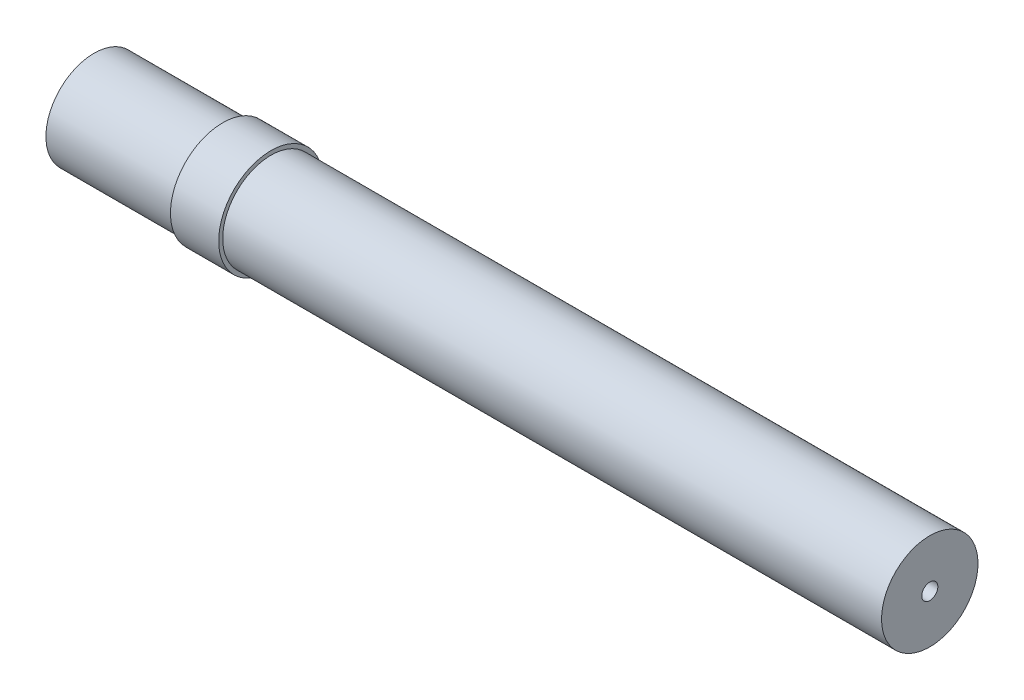
ISO-10303-21;
HEADER;
FILE_DESCRIPTION(('STEP AP214'),'2;1');
FILE_NAME('part.step','',(''),(''),'','','');
FILE_SCHEMA(('AUTOMOTIVE_DESIGN { 1 0 10303 214 1 1 1 1 }'));
ENDSEC;
DATA;
#1=APPLICATION_CONTEXT('core data for automotive mechanical design processes');
#2=APPLICATION_PROTOCOL_DEFINITION('international standard','automotive_design',2000,#1);
#3=PRODUCT_CONTEXT('',#1,'mechanical');
#4=PRODUCT('Part','Part','',(#3));
#5=PRODUCT_RELATED_PRODUCT_CATEGORY('part','',(#4));
#6=PRODUCT_DEFINITION_FORMATION('','',#4);
#7=PRODUCT_DEFINITION_CONTEXT('part definition',#1,'design');
#8=PRODUCT_DEFINITION('design','',#6,#7);
#9=PRODUCT_DEFINITION_SHAPE('','',#8);
#10=(LENGTH_UNIT() NAMED_UNIT(*) SI_UNIT(.MILLI.,.METRE.));
#11=(NAMED_UNIT(*) PLANE_ANGLE_UNIT() SI_UNIT($,.RADIAN.));
#12=(NAMED_UNIT(*) SI_UNIT($,.STERADIAN.) SOLID_ANGLE_UNIT());
#13=UNCERTAINTY_MEASURE_WITH_UNIT(LENGTH_MEASURE(1.E-05),#10,'distance_accuracy_value','');
#14=(GEOMETRIC_REPRESENTATION_CONTEXT(3) GLOBAL_UNCERTAINTY_ASSIGNED_CONTEXT((#13)) GLOBAL_UNIT_ASSIGNED_CONTEXT((#10,
#11,#12)) REPRESENTATION_CONTEXT('',''));
#15=CARTESIAN_POINT('',(0.,0.,0.));
#16=DIRECTION('',(0.,0.,1.));
#17=DIRECTION('',(1.,0.,0.));
#18=AXIS2_PLACEMENT_3D('',#15,#16,#17);
#19=CARTESIAN_POINT('',(13.5,0.,0.));
#20=DIRECTION('',(1.,0.,0.));
#21=DIRECTION('',(0.,0.,-1.));
#22=AXIS2_PLACEMENT_3D('',#19,#20,#21);
#23=CYLINDRICAL_SURFACE('',#22,3.25);
#24=CARTESIAN_POINT('',(-33.,0.,0.));
#25=DIRECTION('',(1.,0.,0.));
#26=DIRECTION('',(0.,0.,-1.));
#27=AXIS2_PLACEMENT_3D('',#24,#25,#26);
#28=CIRCLE('',#27,3.24999999999999);
#29=CARTESIAN_POINT('',(-33.,0.,-3.24999999999999));
#30=VERTEX_POINT('',#29);
#31=EDGE_CURVE('E10',#30,#30,#28,.T.);
#32=ORIENTED_EDGE('',*,*,#31,.T.);
#33=EDGE_LOOP('',(#32));
#34=FACE_BOUND('',#33,.T.);
#35=CARTESIAN_POINT('',(-30.,0.,0.));
#36=DIRECTION('',(1.,0.,0.));
#37=DIRECTION('',(0.,0.,-1.));
#38=AXIS2_PLACEMENT_3D('',#35,#36,#37);
#39=CIRCLE('',#38,3.25);
#40=CARTESIAN_POINT('',(-30.,0.,-3.25));
#41=VERTEX_POINT('',#40);
#42=EDGE_CURVE('E86',#41,#41,#39,.T.);
#43=ORIENTED_EDGE('',*,*,#42,.F.);
#44=EDGE_LOOP('',(#43));
#45=FACE_BOUND('',#44,.T.);
#46=ADVANCED_FACE('F43',(#34,#45),#23,.T.);
#47=CARTESIAN_POINT('',(-33.,3.24999999999999,0.));
#48=DIRECTION('',(-1.,0.,0.));
#49=DIRECTION('',(0.,0.,1.));
#50=AXIS2_PLACEMENT_3D('',#47,#48,#49);
#51=PLANE('',#50);
#52=CARTESIAN_POINT('',(-33.,0.,0.));
#53=DIRECTION('',(1.,0.,0.));
#54=DIRECTION('',(0.,0.,-1.));
#55=AXIS2_PLACEMENT_3D('',#52,#53,#54);
#56=CIRCLE('',#55,2.99999999999999);
#57=CARTESIAN_POINT('',(-33.,0.,-2.99999999999999));
#58=VERTEX_POINT('',#57);
#59=EDGE_CURVE('E50',#58,#58,#56,.T.);
#60=ORIENTED_EDGE('',*,*,#59,.T.);
#61=EDGE_LOOP('',(#60));
#62=FACE_BOUND('',#61,.T.);
#63=ORIENTED_EDGE('',*,*,#31,.F.);
#64=EDGE_LOOP('',(#63));
#65=FACE_BOUND('',#64,.T.);
#66=ADVANCED_FACE('F95',(#62,#65),#51,.T.);
#67=CARTESIAN_POINT('',(13.5,0.,0.));
#68=DIRECTION('',(1.,0.,0.));
#69=DIRECTION('',(0.,0.,-1.));
#70=AXIS2_PLACEMENT_3D('',#67,#68,#69);
#71=CYLINDRICAL_SURFACE('',#70,2.99999999999999);
#72=CARTESIAN_POINT('',(-41.,0.,0.));
#73=DIRECTION('',(1.,0.,0.));
#74=DIRECTION('',(0.,0.,-1.));
#75=AXIS2_PLACEMENT_3D('',#72,#73,#74);
#76=CIRCLE('',#75,2.99999999999999);
#77=CARTESIAN_POINT('',(-41.,0.,-2.99999999999999));
#78=VERTEX_POINT('',#77);
#79=EDGE_CURVE('E55',#78,#78,#76,.T.);
#80=ORIENTED_EDGE('',*,*,#79,.T.);
#81=EDGE_LOOP('',(#80));
#82=FACE_BOUND('',#81,.T.);
#83=ORIENTED_EDGE('',*,*,#59,.F.);
#84=EDGE_LOOP('',(#83));
#85=FACE_BOUND('',#84,.T.);
#86=ADVANCED_FACE('F99',(#82,#85),#71,.T.);
#87=CARTESIAN_POINT('',(-41.,2.99999999999999,0.));
#88=DIRECTION('',(-1.,0.,0.));
#89=DIRECTION('',(0.,0.,1.));
#90=AXIS2_PLACEMENT_3D('',#87,#88,#89);
#91=PLANE('',#90);
#92=CARTESIAN_POINT('',(-41.,0.,0.));
#93=DIRECTION('',(1.,0.,0.));
#94=DIRECTION('',(0.,0.,-1.));
#95=AXIS2_PLACEMENT_3D('',#92,#93,#94);
#96=CIRCLE('',#95,2.24999999999999);
#97=CARTESIAN_POINT('',(-41.,0.,-2.24999999999999));
#98=VERTEX_POINT('',#97);
#99=EDGE_CURVE('E60',#98,#98,#96,.T.);
#100=ORIENTED_EDGE('',*,*,#99,.T.);
#101=EDGE_LOOP('',(#100));
#102=FACE_BOUND('',#101,.T.);
#103=ORIENTED_EDGE('',*,*,#79,.F.);
#104=EDGE_LOOP('',(#103));
#105=FACE_BOUND('',#104,.T.);
#106=ADVANCED_FACE('F103',(#102,#105),#91,.T.);
#107=CARTESIAN_POINT('',(13.5,0.,0.));
#108=DIRECTION('',(1.,0.,0.));
#109=DIRECTION('',(0.,0.,-1.));
#110=AXIS2_PLACEMENT_3D('',#107,#108,#109);
#111=CYLINDRICAL_SURFACE('',#110,2.25);
#112=CARTESIAN_POINT('',(10.,0.,0.));
#113=DIRECTION('',(1.,0.,0.));
#114=DIRECTION('',(0.,0.,-1.));
#115=AXIS2_PLACEMENT_3D('',#112,#113,#114);
#116=CIRCLE('',#115,2.25);
#117=CARTESIAN_POINT('',(10.,0.,-2.25));
#118=VERTEX_POINT('',#117);
#119=EDGE_CURVE('E66',#118,#118,#116,.T.);
#120=ORIENTED_EDGE('',*,*,#119,.T.);
#121=EDGE_LOOP('',(#120));
#122=FACE_BOUND('',#121,.T.);
#123=ORIENTED_EDGE('',*,*,#99,.F.);
#124=EDGE_LOOP('',(#123));
#125=FACE_BOUND('',#124,.T.);
#126=ADVANCED_FACE('F110',(#122,#125),#111,.F.);
#127=CARTESIAN_POINT('',(10.,0.499999999999998,0.));
#128=DIRECTION('',(-1.,0.,0.));
#129=DIRECTION('',(0.,0.,1.));
#130=AXIS2_PLACEMENT_3D('',#127,#128,#129);
#131=PLANE('',#130);
#132=CARTESIAN_POINT('',(10.,0.,0.));
#133=DIRECTION('',(1.,0.,0.));
#134=DIRECTION('',(0.,0.,-1.));
#135=AXIS2_PLACEMENT_3D('',#132,#133,#134);
#136=CIRCLE('',#135,0.499999999999998);
#137=CARTESIAN_POINT('',(10.,0.,-0.499999999999998));
#138=VERTEX_POINT('',#137);
#139=EDGE_CURVE('E70',#138,#138,#136,.T.);
#140=ORIENTED_EDGE('',*,*,#139,.T.);
#141=EDGE_LOOP('',(#140));
#142=FACE_BOUND('',#141,.T.);
#143=ORIENTED_EDGE('',*,*,#119,.F.);
#144=EDGE_LOOP('',(#143));
#145=FACE_BOUND('',#144,.T.);
#146=ADVANCED_FACE('F114',(#142,#145),#131,.T.);
#147=CARTESIAN_POINT('',(13.5,0.,0.));
#148=DIRECTION('',(1.,0.,0.));
#149=DIRECTION('',(0.,0.,-1.));
#150=AXIS2_PLACEMENT_3D('',#147,#148,#149);
#151=CYLINDRICAL_SURFACE('',#150,0.499999999999998);
#152=CARTESIAN_POINT('',(11.,0.,0.));
#153=DIRECTION('',(1.,0.,0.));
#154=DIRECTION('',(0.,0.,-1.));
#155=AXIS2_PLACEMENT_3D('',#152,#153,#154);
#156=CIRCLE('',#155,0.499999999999998);
#157=CARTESIAN_POINT('',(11.,0.,-0.499999999999998));
#158=VERTEX_POINT('',#157);
#159=EDGE_CURVE('E74',#158,#158,#156,.T.);
#160=ORIENTED_EDGE('',*,*,#159,.T.);
#161=EDGE_LOOP('',(#160));
#162=FACE_BOUND('',#161,.T.);
#163=ORIENTED_EDGE('',*,*,#139,.F.);
#164=EDGE_LOOP('',(#163));
#165=FACE_BOUND('',#164,.T.);
#166=ADVANCED_FACE('F118',(#162,#165),#151,.F.);
#167=CARTESIAN_POINT('',(11.,2.99999999999999,0.));
#168=DIRECTION('',(1.,0.,0.));
#169=DIRECTION('',(0.,0.,-1.));
#170=AXIS2_PLACEMENT_3D('',#167,#168,#169);
#171=PLANE('',#170);
#172=CARTESIAN_POINT('',(11.,0.,0.));
#173=DIRECTION('',(1.,0.,0.));
#174=DIRECTION('',(0.,0.,-1.));
#175=AXIS2_PLACEMENT_3D('',#172,#173,#174);
#176=CIRCLE('',#175,2.99999999999999);
#177=CARTESIAN_POINT('',(11.,0.,-2.99999999999999));
#178=VERTEX_POINT('',#177);
#179=EDGE_CURVE('E78',#178,#178,#176,.T.);
#180=ORIENTED_EDGE('',*,*,#179,.T.);
#181=EDGE_LOOP('',(#180));
#182=FACE_BOUND('',#181,.T.);
#183=ORIENTED_EDGE('',*,*,#159,.F.);
#184=EDGE_LOOP('',(#183));
#185=FACE_BOUND('',#184,.T.);
#186=ADVANCED_FACE('F122',(#182,#185),#171,.T.);
#187=CARTESIAN_POINT('',(13.5,0.,0.));
#188=DIRECTION('',(1.,0.,0.));
#189=DIRECTION('',(0.,0.,-1.));
#190=AXIS2_PLACEMENT_3D('',#187,#188,#189);
#191=CYLINDRICAL_SURFACE('',#190,2.99999999999999);
#192=CARTESIAN_POINT('',(-30.,0.,0.));
#193=DIRECTION('',(1.,0.,0.));
#194=DIRECTION('',(0.,0.,-1.));
#195=AXIS2_PLACEMENT_3D('',#192,#193,#194);
#196=CIRCLE('',#195,2.99999999999999);
#197=CARTESIAN_POINT('',(-30.,0.,-2.99999999999999));
#198=VERTEX_POINT('',#197);
#199=EDGE_CURVE('E82',#198,#198,#196,.T.);
#200=ORIENTED_EDGE('',*,*,#199,.T.);
#201=EDGE_LOOP('',(#200));
#202=FACE_BOUND('',#201,.T.);
#203=ORIENTED_EDGE('',*,*,#179,.F.);
#204=EDGE_LOOP('',(#203));
#205=FACE_BOUND('',#204,.T.);
#206=ADVANCED_FACE('F126',(#202,#205),#191,.T.);
#207=CARTESIAN_POINT('',(-30.,3.25,0.));
#208=DIRECTION('',(1.,0.,0.));
#209=DIRECTION('',(0.,0.,-1.));
#210=AXIS2_PLACEMENT_3D('',#207,#208,#209);
#211=PLANE('',#210);
#212=ORIENTED_EDGE('',*,*,#42,.T.);
#213=EDGE_LOOP('',(#212));
#214=FACE_BOUND('',#213,.T.);
#215=ORIENTED_EDGE('',*,*,#199,.F.);
#216=EDGE_LOOP('',(#215));
#217=FACE_BOUND('',#216,.T.);
#218=ADVANCED_FACE('F91',(#214,#217),#211,.T.);
#219=CLOSED_SHELL('',(#46,#66,#86,#106,#126,#146,#166,#186,#206,#218));
#220=MANIFOLD_SOLID_BREP('B2',#219);
#221=ADVANCED_BREP_SHAPE_REPRESENTATION('',(#18,#220),#14);
#222=SHAPE_DEFINITION_REPRESENTATION(#9,#221);
ENDSEC;
END-ISO-10303-21;
